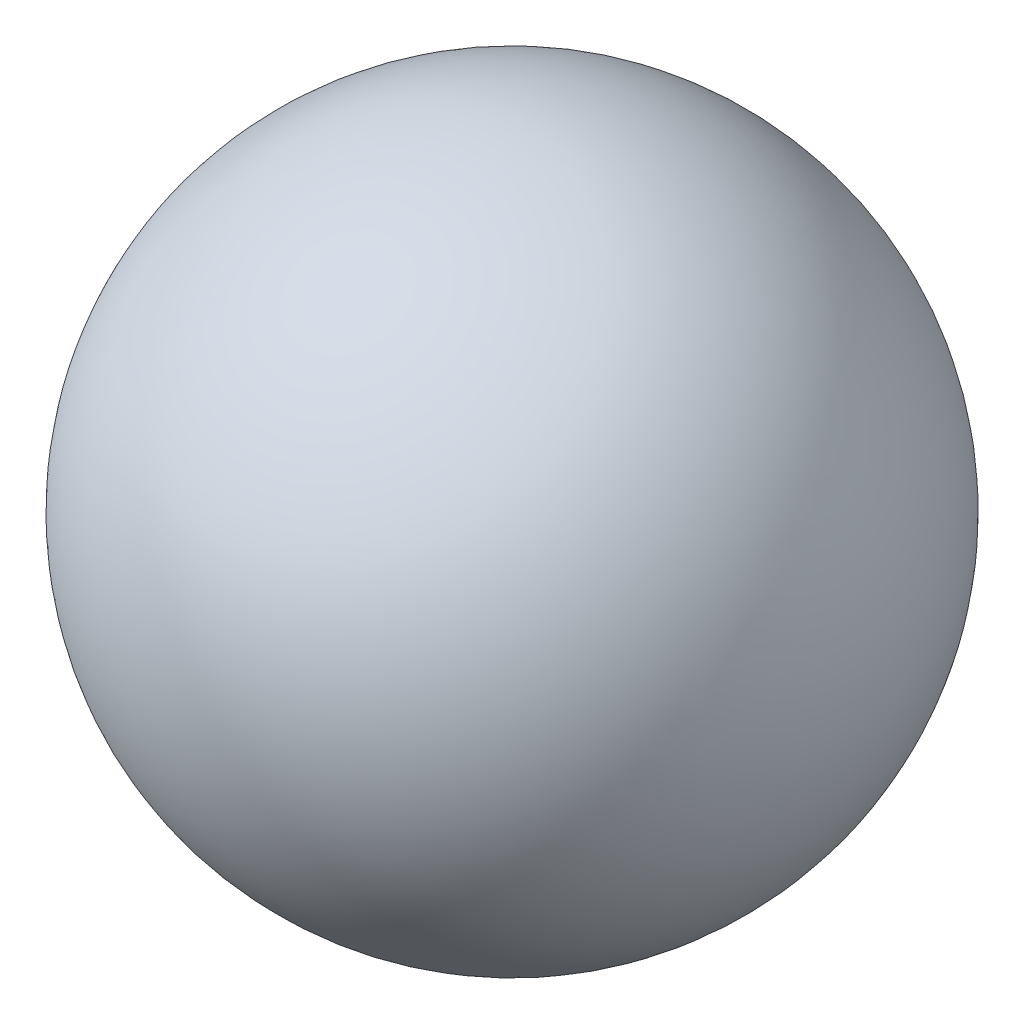
ISO-10303-21;
HEADER;
FILE_DESCRIPTION(('STEP AP214'),'2;1');
FILE_NAME('part.step','',(''),(''),'','','');
FILE_SCHEMA(('AUTOMOTIVE_DESIGN { 1 0 10303 214 1 1 1 1 }'));
ENDSEC;
DATA;
#1=APPLICATION_CONTEXT('core data for automotive mechanical design processes');
#2=APPLICATION_PROTOCOL_DEFINITION('international standard','automotive_design',2000,#1);
#3=PRODUCT_CONTEXT('',#1,'mechanical');
#4=PRODUCT('Part','Part','',(#3));
#5=PRODUCT_RELATED_PRODUCT_CATEGORY('part','',(#4));
#6=PRODUCT_DEFINITION_FORMATION('','',#4);
#7=PRODUCT_DEFINITION_CONTEXT('part definition',#1,'design');
#8=PRODUCT_DEFINITION('design','',#6,#7);
#9=PRODUCT_DEFINITION_SHAPE('','',#8);
#10=(LENGTH_UNIT() NAMED_UNIT(*) SI_UNIT(.MILLI.,.METRE.));
#11=(NAMED_UNIT(*) PLANE_ANGLE_UNIT() SI_UNIT($,.RADIAN.));
#12=(NAMED_UNIT(*) SI_UNIT($,.STERADIAN.) SOLID_ANGLE_UNIT());
#13=UNCERTAINTY_MEASURE_WITH_UNIT(LENGTH_MEASURE(1.E-05),#10,'distance_accuracy_value','');
#14=(GEOMETRIC_REPRESENTATION_CONTEXT(3) GLOBAL_UNCERTAINTY_ASSIGNED_CONTEXT((#13)) GLOBAL_UNIT_ASSIGNED_CONTEXT((#10,
#11,#12)) REPRESENTATION_CONTEXT('',''));
#15=CARTESIAN_POINT('',(0.,0.,0.));
#16=DIRECTION('',(0.,0.,1.));
#17=DIRECTION('',(1.,0.,0.));
#18=AXIS2_PLACEMENT_3D('',#15,#16,#17);
#19=CARTESIAN_POINT('',(0.,0.,0.));
#20=DIRECTION('',(1.,0.,0.));
#21=DIRECTION('',(0.,-1.,0.));
#22=AXIS2_PLACEMENT_3D('',#19,#20,#21);
#23=SPHERICAL_SURFACE('',#22,0.7975);
#24=CARTESIAN_POINT('',(0.7975,0.,0.));
#25=VERTEX_POINT('',#24);
#26=VERTEX_LOOP('',#25);
#27=FACE_BOUND('',#26,.T.);
#28=CARTESIAN_POINT('',(-0.7975,0.,0.));
#29=VERTEX_POINT('',#28);
#30=VERTEX_LOOP('',#29);
#31=FACE_BOUND('',#30,.T.);
#32=ADVANCED_FACE('F16',(#27,#31),#23,.T.);
#33=CLOSED_SHELL('',(#32));
#34=MANIFOLD_SOLID_BREP('B1',#33);
#35=ADVANCED_BREP_SHAPE_REPRESENTATION('',(#18,#34),#14);
#36=SHAPE_DEFINITION_REPRESENTATION(#9,#35);
ENDSEC;
END-ISO-10303-21;
